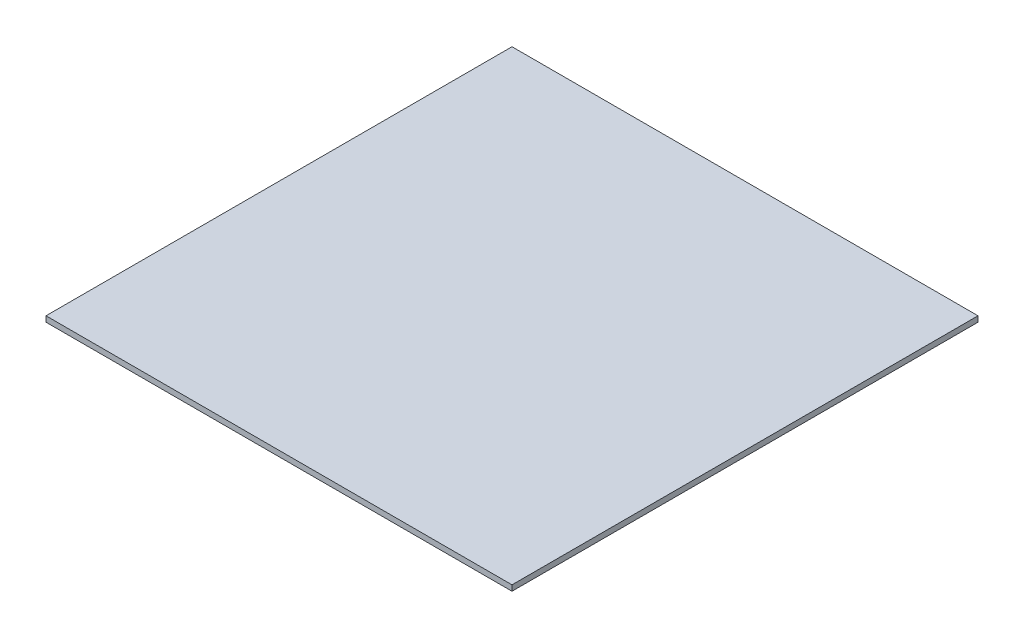
ISO-10303-21;
HEADER;
FILE_DESCRIPTION(('STEP AP214'),'2;1');
FILE_NAME('part.step','',(''),(''),'','','');
FILE_SCHEMA(('AUTOMOTIVE_DESIGN { 1 0 10303 214 1 1 1 1 }'));
ENDSEC;
DATA;
#1=APPLICATION_CONTEXT('core data for automotive mechanical design processes');
#2=APPLICATION_PROTOCOL_DEFINITION('international standard','automotive_design',2000,#1);
#3=PRODUCT_CONTEXT('',#1,'mechanical');
#4=PRODUCT('Part','Part','',(#3));
#5=PRODUCT_RELATED_PRODUCT_CATEGORY('part','',(#4));
#6=PRODUCT_DEFINITION_FORMATION('','',#4);
#7=PRODUCT_DEFINITION_CONTEXT('part definition',#1,'design');
#8=PRODUCT_DEFINITION('design','',#6,#7);
#9=PRODUCT_DEFINITION_SHAPE('','',#8);
#10=(LENGTH_UNIT() NAMED_UNIT(*) SI_UNIT(.MILLI.,.METRE.));
#11=(NAMED_UNIT(*) PLANE_ANGLE_UNIT() SI_UNIT($,.RADIAN.));
#12=(NAMED_UNIT(*) SI_UNIT($,.STERADIAN.) SOLID_ANGLE_UNIT());
#13=UNCERTAINTY_MEASURE_WITH_UNIT(LENGTH_MEASURE(1.E-05),#10,'distance_accuracy_value','');
#14=(GEOMETRIC_REPRESENTATION_CONTEXT(3) GLOBAL_UNCERTAINTY_ASSIGNED_CONTEXT((#13)) GLOBAL_UNIT_ASSIGNED_CONTEXT((#10,
#11,#12)) REPRESENTATION_CONTEXT('',''));
#15=CARTESIAN_POINT('',(0.,0.,0.));
#16=DIRECTION('',(0.,0.,1.));
#17=DIRECTION('',(1.,0.,0.));
#18=AXIS2_PLACEMENT_3D('',#15,#16,#17);
#19=CARTESIAN_POINT('',(250.,6.,250.));
#20=DIRECTION('',(-1.,0.,0.));
#21=DIRECTION('',(0.,0.,1.));
#22=AXIS2_PLACEMENT_3D('',#19,#20,#21);
#23=PLANE('',#22);
#24=DIRECTION('',(0.,0.,-1.));
#25=VECTOR('',#24,1.);
#26=CARTESIAN_POINT('',(250.,0.,250.));
#27=LINE('',#26,#25);
#28=CARTESIAN_POINT('',(250.,0.,250.));
#29=VERTEX_POINT('',#28);
#30=CARTESIAN_POINT('',(250.,0.,-250.));
#31=VERTEX_POINT('',#30);
#32=EDGE_CURVE('E96',#29,#31,#27,.T.);
#33=ORIENTED_EDGE('',*,*,#32,.T.);
#34=DIRECTION('',(0.,-1.,0.));
#35=VECTOR('',#34,1.);
#36=CARTESIAN_POINT('',(250.,6.,-250.));
#37=LINE('',#36,#35);
#38=CARTESIAN_POINT('',(250.,6.,-250.));
#39=VERTEX_POINT('',#38);
#40=EDGE_CURVE('E11',#39,#31,#37,.T.);
#41=ORIENTED_EDGE('',*,*,#40,.F.);
#42=DIRECTION('',(0.,0.,-1.));
#43=VECTOR('',#42,1.);
#44=CARTESIAN_POINT('',(250.,6.,250.));
#45=LINE('',#44,#43);
#46=CARTESIAN_POINT('',(250.,6.,250.));
#47=VERTEX_POINT('',#46);
#48=EDGE_CURVE('E84',#47,#39,#45,.T.);
#49=ORIENTED_EDGE('',*,*,#48,.F.);
#50=DIRECTION('',(0.,-1.,0.));
#51=VECTOR('',#50,1.);
#52=CARTESIAN_POINT('',(250.,6.,250.));
#53=LINE('',#52,#51);
#54=EDGE_CURVE('E92',#47,#29,#53,.T.);
#55=ORIENTED_EDGE('',*,*,#54,.T.);
#56=EDGE_LOOP('',(#33,#41,#49,#55));
#57=FACE_BOUND('',#56,.T.);
#58=ADVANCED_FACE('F33',(#57),#23,.F.);
#59=CARTESIAN_POINT('',(-250.,6.,-250.));
#60=DIRECTION('',(0.,0.,1.));
#61=DIRECTION('',(1.,0.,0.));
#62=AXIS2_PLACEMENT_3D('',#59,#60,#61);
#63=PLANE('',#62);
#64=DIRECTION('',(-1.,0.,0.));
#65=VECTOR('',#64,1.);
#66=CARTESIAN_POINT('',(-250.,0.,-250.));
#67=LINE('',#66,#65);
#68=CARTESIAN_POINT('',(-250.,0.,-250.));
#69=VERTEX_POINT('',#68);
#70=EDGE_CURVE('E88',#31,#69,#67,.T.);
#71=ORIENTED_EDGE('',*,*,#70,.T.);
#72=DIRECTION('',(0.,-1.,0.));
#73=VECTOR('',#72,1.);
#74=CARTESIAN_POINT('',(-250.,6.,-250.));
#75=LINE('',#74,#73);
#76=CARTESIAN_POINT('',(-250.,6.,-250.));
#77=VERTEX_POINT('',#76);
#78=EDGE_CURVE('E41',#77,#69,#75,.T.);
#79=ORIENTED_EDGE('',*,*,#78,.F.);
#80=DIRECTION('',(-1.,0.,0.));
#81=VECTOR('',#80,1.);
#82=CARTESIAN_POINT('',(-250.,6.,-250.));
#83=LINE('',#82,#81);
#84=EDGE_CURVE('E79',#39,#77,#83,.T.);
#85=ORIENTED_EDGE('',*,*,#84,.F.);
#86=ORIENTED_EDGE('',*,*,#40,.T.);
#87=EDGE_LOOP('',(#71,#79,#85,#86));
#88=FACE_BOUND('',#87,.T.);
#89=ADVANCED_FACE('F87',(#88),#63,.F.);
#90=CARTESIAN_POINT('',(-250.,6.,250.));
#91=DIRECTION('',(1.,0.,0.));
#92=DIRECTION('',(0.,0.,-1.));
#93=AXIS2_PLACEMENT_3D('',#90,#91,#92);
#94=PLANE('',#93);
#95=DIRECTION('',(0.,0.,1.));
#96=VECTOR('',#95,1.);
#97=CARTESIAN_POINT('',(-250.,0.,250.));
#98=LINE('',#97,#96);
#99=CARTESIAN_POINT('',(-250.,0.,250.));
#100=VERTEX_POINT('',#99);
#101=EDGE_CURVE('E66',#69,#100,#98,.T.);
#102=ORIENTED_EDGE('',*,*,#101,.T.);
#103=DIRECTION('',(0.,-1.,0.));
#104=VECTOR('',#103,1.);
#105=CARTESIAN_POINT('',(-250.,6.,250.));
#106=LINE('',#105,#104);
#107=CARTESIAN_POINT('',(-250.,6.,250.));
#108=VERTEX_POINT('',#107);
#109=EDGE_CURVE('E89',#108,#100,#106,.T.);
#110=ORIENTED_EDGE('',*,*,#109,.F.);
#111=DIRECTION('',(0.,0.,1.));
#112=VECTOR('',#111,1.);
#113=CARTESIAN_POINT('',(-250.,6.,250.));
#114=LINE('',#113,#112);
#115=EDGE_CURVE('E82',#77,#108,#114,.T.);
#116=ORIENTED_EDGE('',*,*,#115,.F.);
#117=ORIENTED_EDGE('',*,*,#78,.T.);
#118=EDGE_LOOP('',(#102,#110,#116,#117));
#119=FACE_BOUND('',#118,.T.);
#120=ADVANCED_FACE('F90',(#119),#94,.F.);
#121=CARTESIAN_POINT('',(-250.,6.,250.));
#122=DIRECTION('',(0.,0.,-1.));
#123=DIRECTION('',(-1.,0.,0.));
#124=AXIS2_PLACEMENT_3D('',#121,#122,#123);
#125=PLANE('',#124);
#126=DIRECTION('',(1.,0.,0.));
#127=VECTOR('',#126,1.);
#128=CARTESIAN_POINT('',(-250.,0.,250.));
#129=LINE('',#128,#127);
#130=EDGE_CURVE('E72',#100,#29,#129,.T.);
#131=ORIENTED_EDGE('',*,*,#130,.T.);
#132=ORIENTED_EDGE('',*,*,#54,.F.);
#133=DIRECTION('',(1.,0.,0.));
#134=VECTOR('',#133,1.);
#135=CARTESIAN_POINT('',(-250.,6.,250.));
#136=LINE('',#135,#134);
#137=EDGE_CURVE('E49',#108,#47,#136,.T.);
#138=ORIENTED_EDGE('',*,*,#137,.F.);
#139=ORIENTED_EDGE('',*,*,#109,.T.);
#140=EDGE_LOOP('',(#131,#132,#138,#139));
#141=FACE_BOUND('',#140,.T.);
#142=ADVANCED_FACE('F103',(#141),#125,.F.);
#143=CARTESIAN_POINT('',(0.,6.,0.));
#144=DIRECTION('',(0.,-1.,0.));
#145=DIRECTION('',(0.,0.,-1.));
#146=AXIS2_PLACEMENT_3D('',#143,#144,#145);
#147=PLANE('',#146);
#148=ORIENTED_EDGE('',*,*,#48,.T.);
#149=ORIENTED_EDGE('',*,*,#84,.T.);
#150=ORIENTED_EDGE('',*,*,#115,.T.);
#151=ORIENTED_EDGE('',*,*,#137,.T.);
#152=EDGE_LOOP('',(#148,#149,#150,#151));
#153=FACE_BOUND('',#152,.T.);
#154=ADVANCED_FACE('F80',(#153),#147,.F.);
#155=CARTESIAN_POINT('',(0.,0.,0.));
#156=DIRECTION('',(0.,-1.,0.));
#157=DIRECTION('',(0.,0.,-1.));
#158=AXIS2_PLACEMENT_3D('',#155,#156,#157);
#159=PLANE('',#158);
#160=ORIENTED_EDGE('',*,*,#32,.F.);
#161=ORIENTED_EDGE('',*,*,#130,.F.);
#162=ORIENTED_EDGE('',*,*,#101,.F.);
#163=ORIENTED_EDGE('',*,*,#70,.F.);
#164=EDGE_LOOP('',(#160,#161,#162,#163));
#165=FACE_BOUND('',#164,.T.);
#166=ADVANCED_FACE('F106',(#165),#159,.T.);
#167=CLOSED_SHELL('',(#58,#89,#120,#142,#154,#166));
#168=MANIFOLD_SOLID_BREP('B2',#167);
#169=ADVANCED_BREP_SHAPE_REPRESENTATION('',(#18,#168),#14);
#170=SHAPE_DEFINITION_REPRESENTATION(#9,#169);
ENDSEC;
END-ISO-10303-21;
